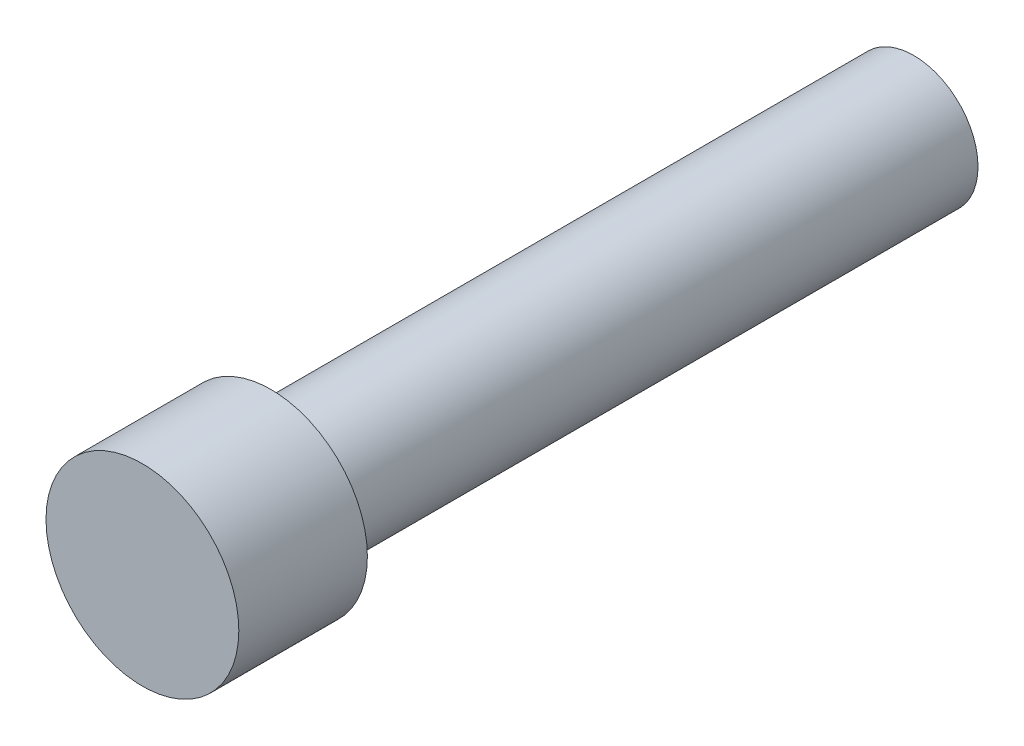
ISO-10303-21;
HEADER;
FILE_DESCRIPTION(('STEP AP214'),'2;1');
FILE_NAME('part.step','',(''),(''),'','','');
FILE_SCHEMA(('AUTOMOTIVE_DESIGN { 1 0 10303 214 1 1 1 1 }'));
ENDSEC;
DATA;
#1=APPLICATION_CONTEXT('core data for automotive mechanical design processes');
#2=APPLICATION_PROTOCOL_DEFINITION('international standard','automotive_design',2000,#1);
#3=PRODUCT_CONTEXT('',#1,'mechanical');
#4=PRODUCT('Part','Part','',(#3));
#5=PRODUCT_RELATED_PRODUCT_CATEGORY('part','',(#4));
#6=PRODUCT_DEFINITION_FORMATION('','',#4);
#7=PRODUCT_DEFINITION_CONTEXT('part definition',#1,'design');
#8=PRODUCT_DEFINITION('design','',#6,#7);
#9=PRODUCT_DEFINITION_SHAPE('','',#8);
#10=(LENGTH_UNIT() NAMED_UNIT(*) SI_UNIT(.MILLI.,.METRE.));
#11=(NAMED_UNIT(*) PLANE_ANGLE_UNIT() SI_UNIT($,.RADIAN.));
#12=(NAMED_UNIT(*) SI_UNIT($,.STERADIAN.) SOLID_ANGLE_UNIT());
#13=UNCERTAINTY_MEASURE_WITH_UNIT(LENGTH_MEASURE(1.E-05),#10,'distance_accuracy_value','');
#14=(GEOMETRIC_REPRESENTATION_CONTEXT(3) GLOBAL_UNCERTAINTY_ASSIGNED_CONTEXT((#13)) GLOBAL_UNIT_ASSIGNED_CONTEXT((#10,
#11,#12)) REPRESENTATION_CONTEXT('',''));
#15=CARTESIAN_POINT('',(0.,0.,0.));
#16=DIRECTION('',(0.,0.,1.));
#17=DIRECTION('',(1.,0.,0.));
#18=AXIS2_PLACEMENT_3D('',#15,#16,#17);
#19=CARTESIAN_POINT('',(0.,0.,2.5));
#20=DIRECTION('',(0.,0.,-1.));
#21=DIRECTION('',(-1.,0.,0.));
#22=AXIS2_PLACEMENT_3D('',#19,#20,#21);
#23=CYLINDRICAL_SURFACE('',#22,0.25);
#24=CARTESIAN_POINT('',(0.,0.,2.5));
#25=DIRECTION('',(0.,0.,1.));
#26=DIRECTION('',(1.,0.,0.));
#27=AXIS2_PLACEMENT_3D('',#24,#25,#26);
#28=CIRCLE('',#27,0.25);
#29=CARTESIAN_POINT('',(0.25,0.,2.5));
#30=VERTEX_POINT('',#29);
#31=EDGE_CURVE('E10',#30,#30,#28,.T.);
#32=ORIENTED_EDGE('',*,*,#31,.F.);
#33=EDGE_LOOP('',(#32));
#34=FACE_BOUND('',#33,.T.);
#35=CARTESIAN_POINT('',(0.,0.,0.));
#36=DIRECTION('',(0.,0.,1.));
#37=DIRECTION('',(1.,0.,0.));
#38=AXIS2_PLACEMENT_3D('',#35,#36,#37);
#39=CIRCLE('',#38,0.25);
#40=CARTESIAN_POINT('',(0.25,0.,0.));
#41=VERTEX_POINT('',#40);
#42=EDGE_CURVE('E37',#41,#41,#39,.T.);
#43=ORIENTED_EDGE('',*,*,#42,.T.);
#44=EDGE_LOOP('',(#43));
#45=FACE_BOUND('',#44,.T.);
#46=ADVANCED_FACE('F34',(#34,#45),#23,.T.);
#47=CARTESIAN_POINT('',(0.,0.,0.));
#48=DIRECTION('',(0.,0.,1.));
#49=DIRECTION('',(1.,0.,0.));
#50=AXIS2_PLACEMENT_3D('',#47,#48,#49);
#51=PLANE('',#50);
#52=ORIENTED_EDGE('',*,*,#42,.F.);
#53=EDGE_LOOP('',(#52));
#54=FACE_BOUND('',#53,.T.);
#55=ADVANCED_FACE('F57',(#54),#51,.F.);
#56=CARTESIAN_POINT('',(0.,0.,3.));
#57=DIRECTION('',(0.,0.,-1.));
#58=DIRECTION('',(-1.,0.,0.));
#59=AXIS2_PLACEMENT_3D('',#56,#57,#58);
#60=CYLINDRICAL_SURFACE('',#59,0.375);
#61=CARTESIAN_POINT('',(0.,0.,3.));
#62=DIRECTION('',(0.,0.,1.));
#63=DIRECTION('',(1.,0.,0.));
#64=AXIS2_PLACEMENT_3D('',#61,#62,#63);
#65=CIRCLE('',#64,0.375);
#66=CARTESIAN_POINT('',(0.375,0.,3.));
#67=VERTEX_POINT('',#66);
#68=EDGE_CURVE('E44',#67,#67,#65,.T.);
#69=ORIENTED_EDGE('',*,*,#68,.F.);
#70=EDGE_LOOP('',(#69));
#71=FACE_BOUND('',#70,.T.);
#72=CARTESIAN_POINT('',(0.,0.,2.5));
#73=DIRECTION('',(0.,0.,1.));
#74=DIRECTION('',(1.,0.,0.));
#75=AXIS2_PLACEMENT_3D('',#72,#73,#74);
#76=CIRCLE('',#75,0.375);
#77=CARTESIAN_POINT('',(0.375,0.,2.5));
#78=VERTEX_POINT('',#77);
#79=EDGE_CURVE('E46',#78,#78,#76,.T.);
#80=ORIENTED_EDGE('',*,*,#79,.T.);
#81=EDGE_LOOP('',(#80));
#82=FACE_BOUND('',#81,.T.);
#83=ADVANCED_FACE('F54',(#71,#82),#60,.T.);
#84=CARTESIAN_POINT('',(0.,0.,3.));
#85=DIRECTION('',(0.,0.,1.));
#86=DIRECTION('',(1.,0.,0.));
#87=AXIS2_PLACEMENT_3D('',#84,#85,#86);
#88=PLANE('',#87);
#89=ORIENTED_EDGE('',*,*,#68,.T.);
#90=EDGE_LOOP('',(#89));
#91=FACE_BOUND('',#90,.T.);
#92=ADVANCED_FACE('F52',(#91),#88,.T.);
#93=CARTESIAN_POINT('',(0.,0.,2.5));
#94=DIRECTION('',(0.,0.,1.));
#95=DIRECTION('',(1.,0.,0.));
#96=AXIS2_PLACEMENT_3D('',#93,#94,#95);
#97=PLANE('',#96);
#98=ORIENTED_EDGE('',*,*,#31,.T.);
#99=EDGE_LOOP('',(#98));
#100=FACE_BOUND('',#99,.T.);
#101=ORIENTED_EDGE('',*,*,#79,.F.);
#102=EDGE_LOOP('',(#101));
#103=FACE_BOUND('',#102,.T.);
#104=ADVANCED_FACE('F61',(#100,#103),#97,.F.);
#105=CLOSED_SHELL('',(#46,#55,#83,#92,#104));
#106=MANIFOLD_SOLID_BREP('B2',#105);
#107=ADVANCED_BREP_SHAPE_REPRESENTATION('',(#18,#106),#14);
#108=SHAPE_DEFINITION_REPRESENTATION(#9,#107);
ENDSEC;
END-ISO-10303-21;
